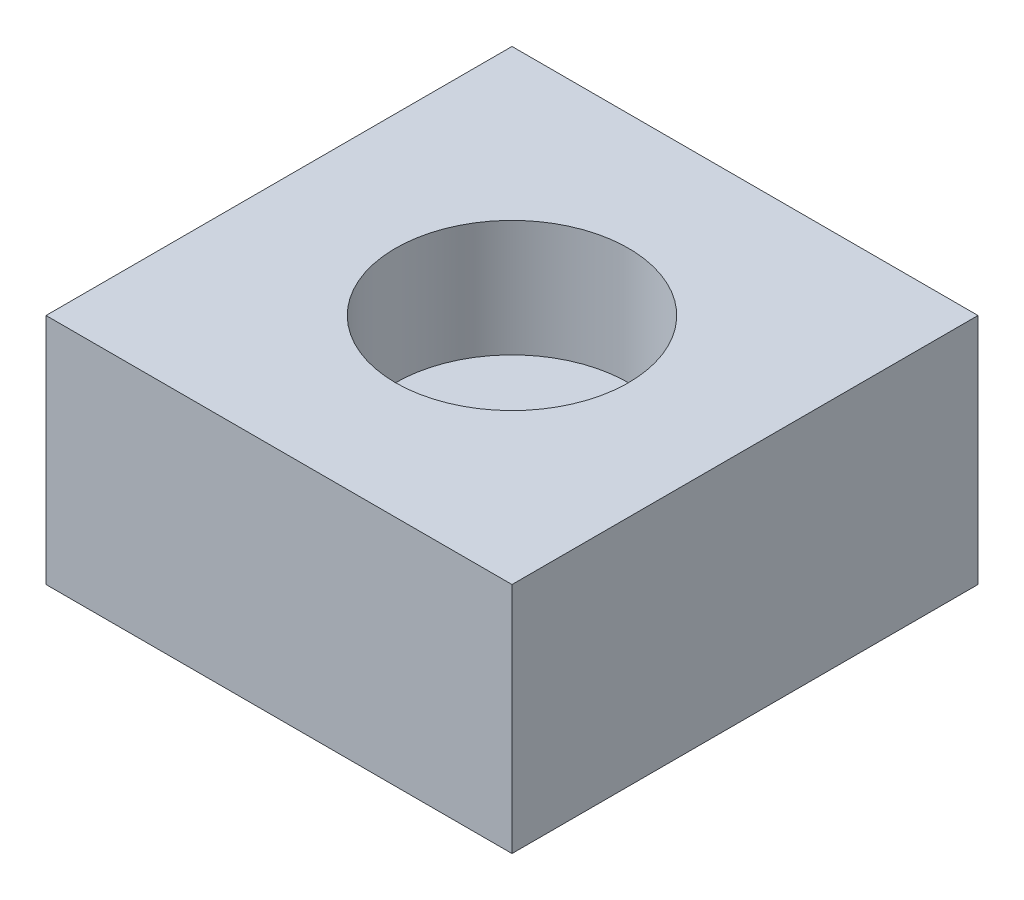
ISO-10303-21;
HEADER;
FILE_DESCRIPTION(('STEP AP214'),'2;1');
FILE_NAME('part.step','',(''),(''),'','','');
FILE_SCHEMA(('AUTOMOTIVE_DESIGN { 1 0 10303 214 1 1 1 1 }'));
ENDSEC;
DATA;
#1=APPLICATION_CONTEXT('core data for automotive mechanical design processes');
#2=APPLICATION_PROTOCOL_DEFINITION('international standard','automotive_design',2000,#1);
#3=PRODUCT_CONTEXT('',#1,'mechanical');
#4=PRODUCT('Part','Part','',(#3));
#5=PRODUCT_RELATED_PRODUCT_CATEGORY('part','',(#4));
#6=PRODUCT_DEFINITION_FORMATION('','',#4);
#7=PRODUCT_DEFINITION_CONTEXT('part definition',#1,'design');
#8=PRODUCT_DEFINITION('design','',#6,#7);
#9=PRODUCT_DEFINITION_SHAPE('','',#8);
#10=(LENGTH_UNIT() NAMED_UNIT(*) SI_UNIT(.MILLI.,.METRE.));
#11=(NAMED_UNIT(*) PLANE_ANGLE_UNIT() SI_UNIT($,.RADIAN.));
#12=(NAMED_UNIT(*) SI_UNIT($,.STERADIAN.) SOLID_ANGLE_UNIT());
#13=UNCERTAINTY_MEASURE_WITH_UNIT(LENGTH_MEASURE(1.E-05),#10,'distance_accuracy_value','');
#14=(GEOMETRIC_REPRESENTATION_CONTEXT(3) GLOBAL_UNCERTAINTY_ASSIGNED_CONTEXT((#13)) GLOBAL_UNIT_ASSIGNED_CONTEXT((#10,
#11,#12)) REPRESENTATION_CONTEXT('',''));
#15=CARTESIAN_POINT('',(0.,0.,0.));
#16=DIRECTION('',(0.,0.,1.));
#17=DIRECTION('',(1.,0.,0.));
#18=AXIS2_PLACEMENT_3D('',#15,#16,#17);
#19=CARTESIAN_POINT('',(0.,10.,0.));
#20=DIRECTION('',(1.,0.,0.));
#21=DIRECTION('',(0.,0.,-1.));
#22=AXIS2_PLACEMENT_3D('',#19,#20,#21);
#23=PLANE('',#22);
#24=DIRECTION('',(0.,0.,1.));
#25=VECTOR('',#24,1.);
#26=CARTESIAN_POINT('',(0.,0.,0.));
#27=LINE('',#26,#25);
#28=CARTESIAN_POINT('',(0.,0.,-20.));
#29=VERTEX_POINT('',#28);
#30=CARTESIAN_POINT('',(0.,0.,0.));
#31=VERTEX_POINT('',#30);
#32=EDGE_CURVE('E94',#29,#31,#27,.T.);
#33=ORIENTED_EDGE('',*,*,#32,.T.);
#34=DIRECTION('',(0.,-1.,0.));
#35=VECTOR('',#34,1.);
#36=CARTESIAN_POINT('',(0.,10.,0.));
#37=LINE('',#36,#35);
#38=CARTESIAN_POINT('',(0.,10.,0.));
#39=VERTEX_POINT('',#38);
#40=EDGE_CURVE('E11',#39,#31,#37,.T.);
#41=ORIENTED_EDGE('',*,*,#40,.F.);
#42=DIRECTION('',(0.,0.,1.));
#43=VECTOR('',#42,1.);
#44=CARTESIAN_POINT('',(0.,10.,0.));
#45=LINE('',#44,#43);
#46=CARTESIAN_POINT('',(0.,10.,-20.));
#47=VERTEX_POINT('',#46);
#48=EDGE_CURVE('E82',#47,#39,#45,.T.);
#49=ORIENTED_EDGE('',*,*,#48,.F.);
#50=DIRECTION('',(0.,-1.,0.));
#51=VECTOR('',#50,1.);
#52=CARTESIAN_POINT('',(0.,10.,-20.));
#53=LINE('',#52,#51);
#54=EDGE_CURVE('E90',#47,#29,#53,.T.);
#55=ORIENTED_EDGE('',*,*,#54,.T.);
#56=EDGE_LOOP('',(#33,#41,#49,#55));
#57=FACE_BOUND('',#56,.T.);
#58=ADVANCED_FACE('F31',(#57),#23,.F.);
#59=CARTESIAN_POINT('',(0.,10.,0.));
#60=DIRECTION('',(0.,0.,-1.));
#61=DIRECTION('',(-1.,0.,0.));
#62=AXIS2_PLACEMENT_3D('',#59,#60,#61);
#63=PLANE('',#62);
#64=DIRECTION('',(1.,0.,0.));
#65=VECTOR('',#64,1.);
#66=CARTESIAN_POINT('',(0.,0.,0.));
#67=LINE('',#66,#65);
#68=CARTESIAN_POINT('',(20.,0.,0.));
#69=VERTEX_POINT('',#68);
#70=EDGE_CURVE('E86',#31,#69,#67,.T.);
#71=ORIENTED_EDGE('',*,*,#70,.T.);
#72=DIRECTION('',(0.,-1.,0.));
#73=VECTOR('',#72,1.);
#74=CARTESIAN_POINT('',(20.,10.,0.));
#75=LINE('',#74,#73);
#76=CARTESIAN_POINT('',(20.,10.,0.));
#77=VERTEX_POINT('',#76);
#78=EDGE_CURVE('E39',#77,#69,#75,.T.);
#79=ORIENTED_EDGE('',*,*,#78,.F.);
#80=DIRECTION('',(1.,0.,0.));
#81=VECTOR('',#80,1.);
#82=CARTESIAN_POINT('',(0.,10.,0.));
#83=LINE('',#82,#81);
#84=EDGE_CURVE('E77',#39,#77,#83,.T.);
#85=ORIENTED_EDGE('',*,*,#84,.F.);
#86=ORIENTED_EDGE('',*,*,#40,.T.);
#87=EDGE_LOOP('',(#71,#79,#85,#86));
#88=FACE_BOUND('',#87,.T.);
#89=ADVANCED_FACE('F85',(#88),#63,.F.);
#90=CARTESIAN_POINT('',(20.,10.,0.));
#91=DIRECTION('',(-1.,0.,0.));
#92=DIRECTION('',(0.,0.,1.));
#93=AXIS2_PLACEMENT_3D('',#90,#91,#92);
#94=PLANE('',#93);
#95=DIRECTION('',(0.,0.,-1.));
#96=VECTOR('',#95,1.);
#97=CARTESIAN_POINT('',(20.,0.,0.));
#98=LINE('',#97,#96);
#99=CARTESIAN_POINT('',(20.,0.,-20.));
#100=VERTEX_POINT('',#99);
#101=EDGE_CURVE('E64',#69,#100,#98,.T.);
#102=ORIENTED_EDGE('',*,*,#101,.T.);
#103=DIRECTION('',(0.,-1.,0.));
#104=VECTOR('',#103,1.);
#105=CARTESIAN_POINT('',(20.,10.,-20.));
#106=LINE('',#105,#104);
#107=CARTESIAN_POINT('',(20.,10.,-20.));
#108=VERTEX_POINT('',#107);
#109=EDGE_CURVE('E87',#108,#100,#106,.T.);
#110=ORIENTED_EDGE('',*,*,#109,.F.);
#111=DIRECTION('',(0.,0.,-1.));
#112=VECTOR('',#111,1.);
#113=CARTESIAN_POINT('',(20.,10.,0.));
#114=LINE('',#113,#112);
#115=EDGE_CURVE('E80',#77,#108,#114,.T.);
#116=ORIENTED_EDGE('',*,*,#115,.F.);
#117=ORIENTED_EDGE('',*,*,#78,.T.);
#118=EDGE_LOOP('',(#102,#110,#116,#117));
#119=FACE_BOUND('',#118,.T.);
#120=ADVANCED_FACE('F88',(#119),#94,.F.);
#121=CARTESIAN_POINT('',(0.,10.,-20.));
#122=DIRECTION('',(0.,0.,1.));
#123=DIRECTION('',(1.,0.,0.));
#124=AXIS2_PLACEMENT_3D('',#121,#122,#123);
#125=PLANE('',#124);
#126=DIRECTION('',(-1.,0.,0.));
#127=VECTOR('',#126,1.);
#128=CARTESIAN_POINT('',(0.,0.,-20.));
#129=LINE('',#128,#127);
#130=EDGE_CURVE('E70',#100,#29,#129,.T.);
#131=ORIENTED_EDGE('',*,*,#130,.T.);
#132=ORIENTED_EDGE('',*,*,#54,.F.);
#133=DIRECTION('',(-1.,0.,0.));
#134=VECTOR('',#133,1.);
#135=CARTESIAN_POINT('',(0.,10.,-20.));
#136=LINE('',#135,#134);
#137=EDGE_CURVE('E47',#108,#47,#136,.T.);
#138=ORIENTED_EDGE('',*,*,#137,.F.);
#139=ORIENTED_EDGE('',*,*,#109,.T.);
#140=EDGE_LOOP('',(#131,#132,#138,#139));
#141=FACE_BOUND('',#140,.T.);
#142=ADVANCED_FACE('F102',(#141),#125,.F.);
#143=CARTESIAN_POINT('',(0.,10.,-20.));
#144=DIRECTION('',(0.,-1.,0.));
#145=DIRECTION('',(0.,0.,-1.));
#146=AXIS2_PLACEMENT_3D('',#143,#144,#145);
#147=PLANE('',#146);
#148=CARTESIAN_POINT('',(10.,10.,-10.));
#149=DIRECTION('',(0.,1.,0.));
#150=DIRECTION('',(0.,0.,1.));
#151=AXIS2_PLACEMENT_3D('',#148,#149,#150);
#152=CIRCLE('',#151,5.);
#153=CARTESIAN_POINT('',(10.,10.,-5.));
#154=VERTEX_POINT('',#153);
#155=EDGE_CURVE('E108',#154,#154,#152,.T.);
#156=ORIENTED_EDGE('',*,*,#155,.F.);
#157=EDGE_LOOP('',(#156));
#158=FACE_BOUND('',#157,.T.);
#159=ORIENTED_EDGE('',*,*,#48,.T.);
#160=ORIENTED_EDGE('',*,*,#84,.T.);
#161=ORIENTED_EDGE('',*,*,#115,.T.);
#162=ORIENTED_EDGE('',*,*,#137,.T.);
#163=EDGE_LOOP('',(#159,#160,#161,#162));
#164=FACE_BOUND('',#163,.T.);
#165=ADVANCED_FACE('F78',(#158,#164),#147,.F.);
#166=CARTESIAN_POINT('',(0.,0.,-20.));
#167=DIRECTION('',(0.,-1.,0.));
#168=DIRECTION('',(0.,0.,-1.));
#169=AXIS2_PLACEMENT_3D('',#166,#167,#168);
#170=PLANE('',#169);
#171=ORIENTED_EDGE('',*,*,#32,.F.);
#172=ORIENTED_EDGE('',*,*,#130,.F.);
#173=ORIENTED_EDGE('',*,*,#101,.F.);
#174=ORIENTED_EDGE('',*,*,#70,.F.);
#175=EDGE_LOOP('',(#171,#172,#173,#174));
#176=FACE_BOUND('',#175,.T.);
#177=ADVANCED_FACE('F105',(#176),#170,.T.);
#178=CARTESIAN_POINT('',(10.,5.,-10.));
#179=DIRECTION('',(0.,1.,0.));
#180=DIRECTION('',(0.,0.,1.));
#181=AXIS2_PLACEMENT_3D('',#178,#179,#180);
#182=CYLINDRICAL_SURFACE('',#181,5.);
#183=CARTESIAN_POINT('',(10.,5.,-10.));
#184=DIRECTION('',(0.,1.,0.));
#185=DIRECTION('',(0.,0.,1.));
#186=AXIS2_PLACEMENT_3D('',#183,#184,#185);
#187=CIRCLE('',#186,5.);
#188=CARTESIAN_POINT('',(10.,5.,-5.));
#189=VERTEX_POINT('',#188);
#190=EDGE_CURVE('E97',#189,#189,#187,.T.);
#191=ORIENTED_EDGE('',*,*,#190,.F.);
#192=EDGE_LOOP('',(#191));
#193=FACE_BOUND('',#192,.T.);
#194=ORIENTED_EDGE('',*,*,#155,.T.);
#195=EDGE_LOOP('',(#194));
#196=FACE_BOUND('',#195,.T.);
#197=ADVANCED_FACE('F116',(#193,#196),#182,.F.);
#198=CARTESIAN_POINT('',(10.,5.,-10.));
#199=DIRECTION('',(0.,1.,0.));
#200=DIRECTION('',(0.,0.,1.));
#201=AXIS2_PLACEMENT_3D('',#198,#199,#200);
#202=PLANE('',#201);
#203=ORIENTED_EDGE('',*,*,#190,.T.);
#204=EDGE_LOOP('',(#203));
#205=FACE_BOUND('',#204,.T.);
#206=ADVANCED_FACE('F114',(#205),#202,.T.);
#207=CLOSED_SHELL('',(#58,#89,#120,#142,#165,#177,#197,#206));
#208=MANIFOLD_SOLID_BREP('B2',#207);
#209=ADVANCED_BREP_SHAPE_REPRESENTATION('',(#18,#208),#14);
#210=SHAPE_DEFINITION_REPRESENTATION(#9,#209);
ENDSEC;
END-ISO-10303-21;
